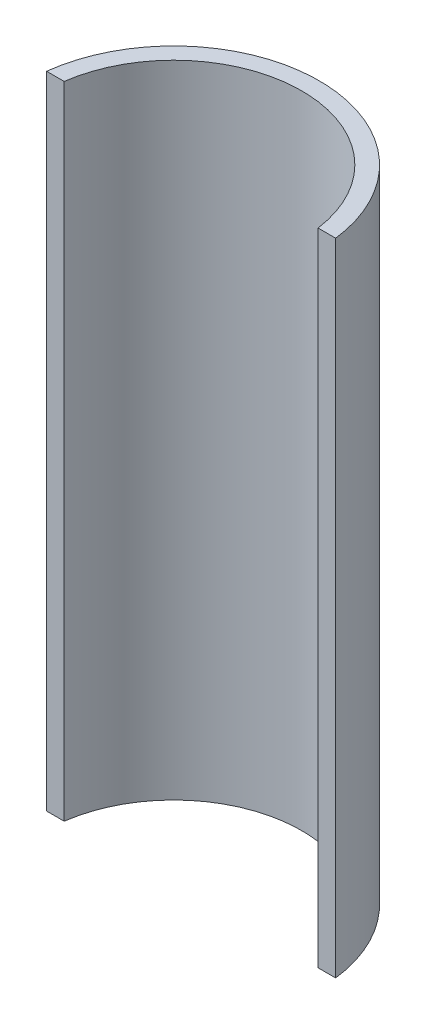
ISO-10303-21;
HEADER;
FILE_DESCRIPTION(('STEP AP214'),'2;1');
FILE_NAME('part.step','',(''),(''),'','','');
FILE_SCHEMA(('AUTOMOTIVE_DESIGN { 1 0 10303 214 1 1 1 1 }'));
ENDSEC;
DATA;
#1=APPLICATION_CONTEXT('core data for automotive mechanical design processes');
#2=APPLICATION_PROTOCOL_DEFINITION('international standard','automotive_design',2000,#1);
#3=PRODUCT_CONTEXT('',#1,'mechanical');
#4=PRODUCT('Part','Part','',(#3));
#5=PRODUCT_RELATED_PRODUCT_CATEGORY('part','',(#4));
#6=PRODUCT_DEFINITION_FORMATION('','',#4);
#7=PRODUCT_DEFINITION_CONTEXT('part definition',#1,'design');
#8=PRODUCT_DEFINITION('design','',#6,#7);
#9=PRODUCT_DEFINITION_SHAPE('','',#8);
#10=(LENGTH_UNIT() NAMED_UNIT(*) SI_UNIT(.MILLI.,.METRE.));
#11=(NAMED_UNIT(*) PLANE_ANGLE_UNIT() SI_UNIT($,.RADIAN.));
#12=(NAMED_UNIT(*) SI_UNIT($,.STERADIAN.) SOLID_ANGLE_UNIT());
#13=UNCERTAINTY_MEASURE_WITH_UNIT(LENGTH_MEASURE(1.E-05),#10,'distance_accuracy_value','');
#14=(GEOMETRIC_REPRESENTATION_CONTEXT(3) GLOBAL_UNCERTAINTY_ASSIGNED_CONTEXT((#13)) GLOBAL_UNIT_ASSIGNED_CONTEXT((#10,
#11,#12)) REPRESENTATION_CONTEXT('',''));
#15=CARTESIAN_POINT('',(0.,0.,0.));
#16=DIRECTION('',(0.,0.,1.));
#17=DIRECTION('',(1.,0.,0.));
#18=AXIS2_PLACEMENT_3D('',#15,#16,#17);
#19=CARTESIAN_POINT('',(21.7944947177034,55.,-3.));
#20=DIRECTION('',(0.,0.,-1.));
#21=DIRECTION('',(-1.,0.,0.));
#22=AXIS2_PLACEMENT_3D('',#19,#20,#21);
#23=PLANE('',#22);
#24=DIRECTION('',(1.,0.,0.));
#25=VECTOR('',#24,1.);
#26=CARTESIAN_POINT('',(21.7944947177034,-55.,-3.));
#27=LINE('',#26,#25);
#28=CARTESIAN_POINT('',(21.7944947177034,-55.,-3.));
#29=VERTEX_POINT('',#28);
#30=CARTESIAN_POINT('',(24.8193472919817,-55.,-3.));
#31=VERTEX_POINT('',#30);
#32=EDGE_CURVE('E96',#29,#31,#27,.T.);
#33=ORIENTED_EDGE('',*,*,#32,.T.);
#34=DIRECTION('',(0.,-1.,0.));
#35=VECTOR('',#34,1.);
#36=CARTESIAN_POINT('',(24.8193472919817,55.,-3.));
#37=LINE('',#36,#35);
#38=CARTESIAN_POINT('',(24.8193472919817,55.,-3.));
#39=VERTEX_POINT('',#38);
#40=EDGE_CURVE('E11',#39,#31,#37,.T.);
#41=ORIENTED_EDGE('',*,*,#40,.F.);
#42=DIRECTION('',(1.,0.,0.));
#43=VECTOR('',#42,1.);
#44=CARTESIAN_POINT('',(21.7944947177034,55.,-3.));
#45=LINE('',#44,#43);
#46=CARTESIAN_POINT('',(21.7944947177034,55.,-3.));
#47=VERTEX_POINT('',#46);
#48=EDGE_CURVE('E82',#47,#39,#45,.T.);
#49=ORIENTED_EDGE('',*,*,#48,.F.);
#50=DIRECTION('',(0.,-1.,0.));
#51=VECTOR('',#50,1.);
#52=CARTESIAN_POINT('',(21.7944947177034,55.,-3.));
#53=LINE('',#52,#51);
#54=EDGE_CURVE('E49',#47,#29,#53,.T.);
#55=ORIENTED_EDGE('',*,*,#54,.T.);
#56=EDGE_LOOP('',(#33,#41,#49,#55));
#57=FACE_BOUND('',#56,.T.);
#58=ADVANCED_FACE('F33',(#57),#23,.F.);
#59=CARTESIAN_POINT('',(0.,55.,0.));
#60=DIRECTION('',(0.,-1.,0.));
#61=DIRECTION('',(0.,0.,-1.));
#62=AXIS2_PLACEMENT_3D('',#59,#60,#61);
#63=CYLINDRICAL_SURFACE('',#62,25.);
#64=CARTESIAN_POINT('',(0.,-55.,0.));
#65=DIRECTION('',(0.,1.,0.));
#66=DIRECTION('',(0.,0.,1.));
#67=AXIS2_PLACEMENT_3D('',#64,#65,#66);
#68=CIRCLE('',#67,25.);
#69=CARTESIAN_POINT('',(-24.8193472919817,-55.,-3.));
#70=VERTEX_POINT('',#69);
#71=EDGE_CURVE('E87',#31,#70,#68,.T.);
#72=ORIENTED_EDGE('',*,*,#71,.T.);
#73=DIRECTION('',(0.,-1.,0.));
#74=VECTOR('',#73,1.);
#75=CARTESIAN_POINT('',(-24.8193472919817,55.,-3.));
#76=LINE('',#75,#74);
#77=CARTESIAN_POINT('',(-24.8193472919817,55.,-3.));
#78=VERTEX_POINT('',#77);
#79=EDGE_CURVE('E41',#78,#70,#76,.T.);
#80=ORIENTED_EDGE('',*,*,#79,.F.);
#81=CARTESIAN_POINT('',(0.,55.,0.));
#82=DIRECTION('',(0.,1.,0.));
#83=DIRECTION('',(0.,0.,1.));
#84=AXIS2_PLACEMENT_3D('',#81,#82,#83);
#85=CIRCLE('',#84,25.);
#86=EDGE_CURVE('E75',#39,#78,#85,.T.);
#87=ORIENTED_EDGE('',*,*,#86,.F.);
#88=ORIENTED_EDGE('',*,*,#40,.T.);
#89=EDGE_LOOP('',(#72,#80,#87,#88));
#90=FACE_BOUND('',#89,.T.);
#91=ADVANCED_FACE('F86',(#90),#63,.T.);
#92=CARTESIAN_POINT('',(-24.8193472919817,55.,-3.));
#93=DIRECTION('',(0.,0.,-1.));
#94=DIRECTION('',(-1.,0.,0.));
#95=AXIS2_PLACEMENT_3D('',#92,#93,#94);
#96=PLANE('',#95);
#97=DIRECTION('',(1.,0.,0.));
#98=VECTOR('',#97,1.);
#99=CARTESIAN_POINT('',(-24.8193472919817,-55.,-3.));
#100=LINE('',#99,#98);
#101=CARTESIAN_POINT('',(-21.7944947177034,-55.,-3.));
#102=VERTEX_POINT('',#101);
#103=EDGE_CURVE('E99',#70,#102,#100,.T.);
#104=ORIENTED_EDGE('',*,*,#103,.T.);
#105=DIRECTION('',(0.,-1.,0.));
#106=VECTOR('',#105,1.);
#107=CARTESIAN_POINT('',(-21.7944947177034,55.,-3.));
#108=LINE('',#107,#106);
#109=CARTESIAN_POINT('',(-21.7944947177034,55.,-3.));
#110=VERTEX_POINT('',#109);
#111=EDGE_CURVE('E64',#110,#102,#108,.T.);
#112=ORIENTED_EDGE('',*,*,#111,.F.);
#113=DIRECTION('',(1.,0.,0.));
#114=VECTOR('',#113,1.);
#115=CARTESIAN_POINT('',(-24.8193472919817,55.,-3.));
#116=LINE('',#115,#114);
#117=EDGE_CURVE('E81',#78,#110,#116,.T.);
#118=ORIENTED_EDGE('',*,*,#117,.F.);
#119=ORIENTED_EDGE('',*,*,#79,.T.);
#120=EDGE_LOOP('',(#104,#112,#118,#119));
#121=FACE_BOUND('',#120,.T.);
#122=ADVANCED_FACE('F90',(#121),#96,.F.);
#123=CARTESIAN_POINT('',(0.,55.,0.));
#124=DIRECTION('',(0.,-1.,0.));
#125=DIRECTION('',(0.,0.,-1.));
#126=AXIS2_PLACEMENT_3D('',#123,#124,#125);
#127=CYLINDRICAL_SURFACE('',#126,22.);
#128=CARTESIAN_POINT('',(0.,-55.,0.));
#129=DIRECTION('',(0.,1.,0.));
#130=DIRECTION('',(0.,0.,1.));
#131=AXIS2_PLACEMENT_3D('',#128,#129,#130);
#132=CIRCLE('',#131,22.);
#133=EDGE_CURVE('E101',#29,#102,#132,.T.);
#134=ORIENTED_EDGE('',*,*,#133,.F.);
#135=ORIENTED_EDGE('',*,*,#54,.F.);
#136=CARTESIAN_POINT('',(0.,55.,0.));
#137=DIRECTION('',(0.,1.,0.));
#138=DIRECTION('',(0.,0.,1.));
#139=AXIS2_PLACEMENT_3D('',#136,#137,#138);
#140=CIRCLE('',#139,22.);
#141=EDGE_CURVE('E91',#47,#110,#140,.T.);
#142=ORIENTED_EDGE('',*,*,#141,.T.);
#143=ORIENTED_EDGE('',*,*,#111,.T.);
#144=EDGE_LOOP('',(#134,#135,#142,#143));
#145=FACE_BOUND('',#144,.T.);
#146=ADVANCED_FACE('F107',(#145),#127,.F.);
#147=CARTESIAN_POINT('',(0.,55.,0.));
#148=DIRECTION('',(0.,1.,0.));
#149=DIRECTION('',(0.,0.,1.));
#150=AXIS2_PLACEMENT_3D('',#147,#148,#149);
#151=PLANE('',#150);
#152=ORIENTED_EDGE('',*,*,#48,.T.);
#153=ORIENTED_EDGE('',*,*,#86,.T.);
#154=ORIENTED_EDGE('',*,*,#117,.T.);
#155=ORIENTED_EDGE('',*,*,#141,.F.);
#156=EDGE_LOOP('',(#152,#153,#154,#155));
#157=FACE_BOUND('',#156,.T.);
#158=ADVANCED_FACE('F78',(#157),#151,.T.);
#159=CARTESIAN_POINT('',(0.,-55.,0.));
#160=DIRECTION('',(0.,1.,0.));
#161=DIRECTION('',(0.,0.,1.));
#162=AXIS2_PLACEMENT_3D('',#159,#160,#161);
#163=PLANE('',#162);
#164=ORIENTED_EDGE('',*,*,#32,.F.);
#165=ORIENTED_EDGE('',*,*,#133,.T.);
#166=ORIENTED_EDGE('',*,*,#103,.F.);
#167=ORIENTED_EDGE('',*,*,#71,.F.);
#168=EDGE_LOOP('',(#164,#165,#166,#167));
#169=FACE_BOUND('',#168,.T.);
#170=ADVANCED_FACE('F106',(#169),#163,.F.);
#171=CLOSED_SHELL('',(#58,#91,#122,#146,#158,#170));
#172=MANIFOLD_SOLID_BREP('B2',#171);
#173=ADVANCED_BREP_SHAPE_REPRESENTATION('',(#18,#172),#14);
#174=SHAPE_DEFINITION_REPRESENTATION(#9,#173);
ENDSEC;
END-ISO-10303-21;
